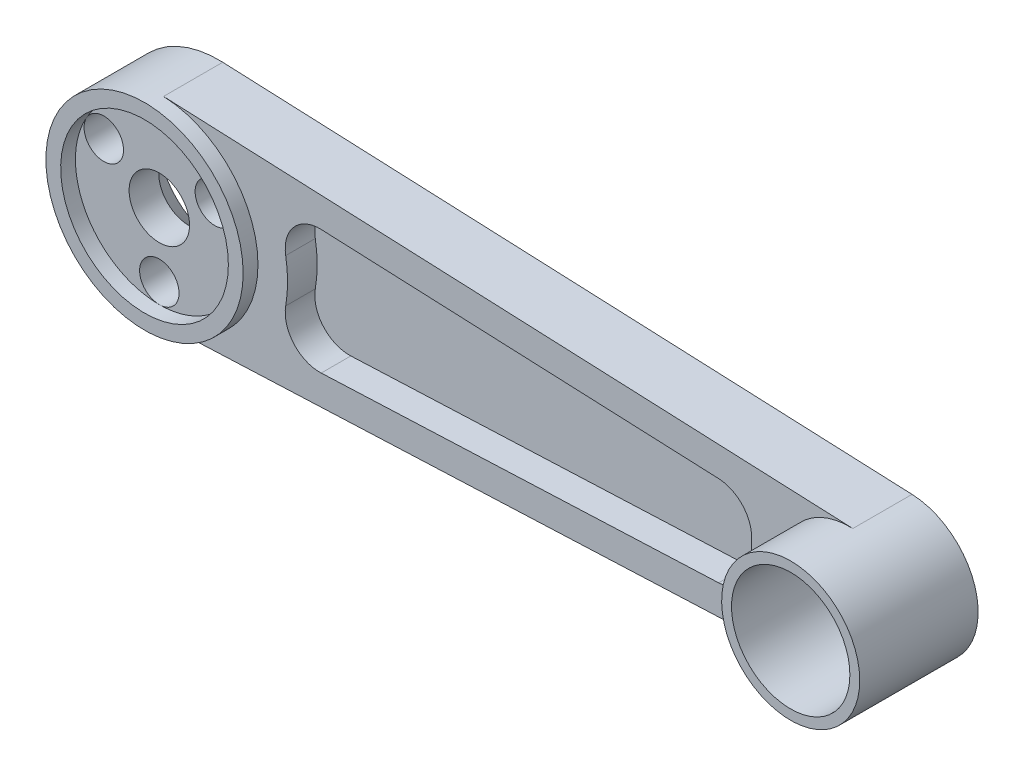
ISO-10303-21;
HEADER;
FILE_DESCRIPTION(('STEP AP214'),'2;1');
FILE_NAME('part.step','',(''),(''),'','','');
FILE_SCHEMA(('AUTOMOTIVE_DESIGN { 1 0 10303 214 1 1 1 1 }'));
ENDSEC;
DATA;
#1=APPLICATION_CONTEXT('core data for automotive mechanical design processes');
#2=APPLICATION_PROTOCOL_DEFINITION('international standard','automotive_design',2000,#1);
#3=PRODUCT_CONTEXT('',#1,'mechanical');
#4=PRODUCT('Part','Part','',(#3));
#5=PRODUCT_RELATED_PRODUCT_CATEGORY('part','',(#4));
#6=PRODUCT_DEFINITION_FORMATION('','',#4);
#7=PRODUCT_DEFINITION_CONTEXT('part definition',#1,'design');
#8=PRODUCT_DEFINITION('design','',#6,#7);
#9=PRODUCT_DEFINITION_SHAPE('','',#8);
#10=(LENGTH_UNIT() NAMED_UNIT(*) SI_UNIT(.MILLI.,.METRE.));
#11=(NAMED_UNIT(*) PLANE_ANGLE_UNIT() SI_UNIT($,.RADIAN.));
#12=(NAMED_UNIT(*) SI_UNIT($,.STERADIAN.) SOLID_ANGLE_UNIT());
#13=UNCERTAINTY_MEASURE_WITH_UNIT(LENGTH_MEASURE(1.E-05),#10,'distance_accuracy_value','');
#14=(GEOMETRIC_REPRESENTATION_CONTEXT(3) GLOBAL_UNCERTAINTY_ASSIGNED_CONTEXT((#13)) GLOBAL_UNIT_ASSIGNED_CONTEXT((#10,
#11,#12)) REPRESENTATION_CONTEXT('',''));
#15=CARTESIAN_POINT('',(0.,0.,0.));
#16=DIRECTION('',(0.,0.,1.));
#17=DIRECTION('',(1.,0.,0.));
#18=AXIS2_PLACEMENT_3D('',#15,#16,#17);
#19=CARTESIAN_POINT('',(0.,0.,6.));
#20=DIRECTION('',(0.,0.,1.));
#21=DIRECTION('',(1.,0.,0.));
#22=AXIS2_PLACEMENT_3D('',#19,#20,#21);
#23=PLANE('',#22);
#24=CARTESIAN_POINT('',(56.5430861553258,1.07771507227869,6.));
#25=DIRECTION('',(0.,0.,1.));
#26=DIRECTION('',(1.,0.,0.));
#27=AXIS2_PLACEMENT_3D('',#24,#25,#26);
#28=CIRCLE('',#27,3.5);
#29=CARTESIAN_POINT('',(60.0319156706117,0.798307460947174,6.));
#30=VERTEX_POINT('',#29);
#31=CARTESIAN_POINT('',(56.6930861553258,4.57449930925986,6.));
#32=VERTEX_POINT('',#31);
#33=EDGE_CURVE('E55',#30,#32,#28,.T.);
#34=ORIENTED_EDGE('',*,*,#33,.F.);
#35=CARTESIAN_POINT('',(70.,0.,6.));
#36=DIRECTION('',(0.,0.,-1.));
#37=DIRECTION('',(-1.,0.,0.));
#38=AXIS2_PLACEMENT_3D('',#35,#36,#37);
#39=CIRCLE('',#38,9.99999999999999);
#40=CARTESIAN_POINT('',(60.0319156706117,-0.798307460947177,6.));
#41=VERTEX_POINT('',#40);
#42=EDGE_CURVE('E159',#41,#30,#39,.T.);
#43=ORIENTED_EDGE('',*,*,#42,.F.);
#44=CARTESIAN_POINT('',(56.5430861553258,-1.07771507227868,6.));
#45=DIRECTION('',(0.,0.,1.));
#46=DIRECTION('',(1.,0.,0.));
#47=AXIS2_PLACEMENT_3D('',#44,#45,#46);
#48=CIRCLE('',#47,3.5);
#49=CARTESIAN_POINT('',(56.6930861553258,-4.57449930925986,6.));
#50=VERTEX_POINT('',#49);
#51=EDGE_CURVE('E162',#50,#41,#48,.T.);
#52=ORIENTED_EDGE('',*,*,#51,.F.);
#53=DIRECTION('',(0.999081210566049,0.0428571428571428,0.));
#54=VECTOR('',#53,1.);
#55=CARTESIAN_POINT('',(16.4097004621313,-6.30251780982247,6.));
#56=LINE('',#55,#54);
#57=CARTESIAN_POINT('',(16.4097004621313,-6.30251780982247,6.));
#58=VERTEX_POINT('',#57);
#59=EDGE_CURVE('E190',#58,#50,#56,.T.);
#60=ORIENTED_EDGE('',*,*,#59,.F.);
#61=CARTESIAN_POINT('',(16.2597004621313,-2.8057335728413,6.));
#62=DIRECTION('',(0.,0.,1.));
#63=DIRECTION('',(1.,0.,0.));
#64=AXIS2_PLACEMENT_3D('',#61,#62,#63);
#65=CIRCLE('',#64,3.5);
#66=CARTESIAN_POINT('',(12.8106730913761,-2.21057796648102,6.));
#67=VERTEX_POINT('',#66);
#68=EDGE_CURVE('E187',#67,#58,#65,.T.);
#69=ORIENTED_EDGE('',*,*,#68,.F.);
#70=CARTESIAN_POINT('',(0.,0.,6.));
#71=DIRECTION('',(0.,0.,-1.));
#72=DIRECTION('',(1.,0.,0.));
#73=AXIS2_PLACEMENT_3D('',#70,#71,#72);
#74=CIRCLE('',#73,13.);
#75=CARTESIAN_POINT('',(12.8106730913761,2.21057796648102,6.));
#76=VERTEX_POINT('',#75);
#77=EDGE_CURVE('E184',#76,#67,#74,.T.);
#78=ORIENTED_EDGE('',*,*,#77,.F.);
#79=CARTESIAN_POINT('',(16.2597004621313,2.8057335728413,6.));
#80=DIRECTION('',(0.,0.,1.));
#81=DIRECTION('',(1.,0.,0.));
#82=AXIS2_PLACEMENT_3D('',#79,#80,#81);
#83=CIRCLE('',#82,3.5);
#84=CARTESIAN_POINT('',(16.4097004621313,6.30251780982247,6.));
#85=VERTEX_POINT('',#84);
#86=EDGE_CURVE('E181',#85,#76,#83,.T.);
#87=ORIENTED_EDGE('',*,*,#86,.F.);
#88=DIRECTION('',(-0.999081210566049,0.0428571428571427,0.));
#89=VECTOR('',#88,1.);
#90=CARTESIAN_POINT('',(16.4097004621313,6.30251780982247,6.));
#91=LINE('',#90,#89);
#92=EDGE_CURVE('E179',#32,#85,#91,.T.);
#93=ORIENTED_EDGE('',*,*,#92,.F.);
#94=EDGE_LOOP('',(#34,#43,#52,#60,#69,#78,#87,#93));
#95=FACE_BOUND('',#94,.T.);
#96=DIRECTION('',(0.999081210566049,0.0428571428571429,0.));
#97=VECTOR('',#96,1.);
#98=CARTESIAN_POINT('',(0.428571428571429,-9.99081210566049,6.));
#99=LINE('',#98,#97);
#100=CARTESIAN_POINT('',(0.428571428571429,-9.99081210566049,6.));
#101=VERTEX_POINT('',#100);
#102=CARTESIAN_POINT('',(70.3,-6.99356847396235,6.));
#103=VERTEX_POINT('',#102);
#104=EDGE_CURVE('E250',#101,#103,#99,.T.);
#105=ORIENTED_EDGE('',*,*,#104,.T.);
#106=CARTESIAN_POINT('',(70.,0.,6.));
#107=DIRECTION('',(0.,0.,1.));
#108=DIRECTION('',(1.,0.,0.));
#109=AXIS2_PLACEMENT_3D('',#106,#107,#108);
#110=CIRCLE('',#109,7.);
#111=CARTESIAN_POINT('',(70.3,6.99356847396235,6.));
#112=VERTEX_POINT('',#111);
#113=EDGE_CURVE('E211',#112,#103,#110,.T.);
#114=ORIENTED_EDGE('',*,*,#113,.F.);
#115=DIRECTION('',(-0.999081210566049,0.0428571428571429,0.));
#116=VECTOR('',#115,1.);
#117=CARTESIAN_POINT('',(0.428571428571429,9.99081210566049,6.));
#118=LINE('',#117,#116);
#119=CARTESIAN_POINT('',(0.428571428571429,9.99081210566049,6.));
#120=VERTEX_POINT('',#119);
#121=EDGE_CURVE('E263',#112,#120,#118,.T.);
#122=ORIENTED_EDGE('',*,*,#121,.T.);
#123=CARTESIAN_POINT('',(0.,0.,6.));
#124=DIRECTION('',(0.,0.,1.));
#125=DIRECTION('',(1.,0.,0.));
#126=AXIS2_PLACEMENT_3D('',#123,#124,#125);
#127=CIRCLE('',#126,10.);
#128=EDGE_CURVE('E275',#101,#120,#127,.T.);
#129=ORIENTED_EDGE('',*,*,#128,.F.);
#130=EDGE_LOOP('',(#105,#114,#122,#129));
#131=FACE_BOUND('',#130,.T.);
#132=ADVANCED_FACE('F40',(#95,#131),#23,.T.);
#133=CARTESIAN_POINT('',(0.,0.,6.));
#134=DIRECTION('',(0.,0.,1.));
#135=DIRECTION('',(1.,0.,0.));
#136=AXIS2_PLACEMENT_3D('',#133,#134,#135);
#137=CIRCLE('',#136,3.0625);
#138=CARTESIAN_POINT('',(3.0625,0.,6.));
#139=VERTEX_POINT('',#138);
#140=EDGE_CURVE('E246',#139,#139,#137,.T.);
#141=ORIENTED_EDGE('',*,*,#140,.F.);
#142=EDGE_LOOP('',(#141));
#143=FACE_BOUND('',#142,.T.);
#144=CARTESIAN_POINT('',(5.62916512459888,3.24999999999995,6.));
#145=DIRECTION('',(0.,0.,1.));
#146=DIRECTION('',(1.,0.,0.));
#147=AXIS2_PLACEMENT_3D('',#144,#145,#146);
#148=CIRCLE('',#147,2.);
#149=CARTESIAN_POINT('',(7.36121593216777,4.24999999999993,6.));
#150=VERTEX_POINT('',#149);
#151=EDGE_CURVE('E227',#150,#150,#148,.T.);
#152=ORIENTED_EDGE('',*,*,#151,.F.);
#153=CARTESIAN_POINT('',(0.,0.,6.));
#154=DIRECTION('',(0.,0.,1.));
#155=DIRECTION('',(1.,0.,0.));
#156=AXIS2_PLACEMENT_3D('',#153,#154,#155);
#157=CIRCLE('',#156,8.5);
#158=CARTESIAN_POINT('',(-7.36121593216771,4.25000000000003,6.));
#159=VERTEX_POINT('',#158);
#160=EDGE_CURVE('E63',#150,#159,#157,.T.);
#161=ORIENTED_EDGE('',*,*,#160,.T.);
#162=CARTESIAN_POINT('',(-5.62916512459884,3.25000000000003,6.));
#163=DIRECTION('',(0.,0.,1.));
#164=DIRECTION('',(1.,0.,0.));
#165=AXIS2_PLACEMENT_3D('',#162,#163,#164);
#166=CIRCLE('',#165,2.);
#167=EDGE_CURVE('E231',#159,#159,#166,.T.);
#168=ORIENTED_EDGE('',*,*,#167,.F.);
#169=CARTESIAN_POINT('',(0.,-8.5,6.));
#170=VERTEX_POINT('',#169);
#171=EDGE_CURVE('E223',#159,#170,#157,.T.);
#172=ORIENTED_EDGE('',*,*,#171,.T.);
#173=CARTESIAN_POINT('',(0.,-6.5,6.));
#174=DIRECTION('',(0.,0.,1.));
#175=DIRECTION('',(1.,0.,0.));
#176=AXIS2_PLACEMENT_3D('',#173,#174,#175);
#177=CIRCLE('',#176,2.);
#178=EDGE_CURVE('E237',#170,#170,#177,.T.);
#179=ORIENTED_EDGE('',*,*,#178,.F.);
#180=EDGE_CURVE('E224',#170,#150,#157,.T.);
#181=ORIENTED_EDGE('',*,*,#180,.T.);
#182=EDGE_LOOP('',(#152,#161,#168,#172,#179,#181));
#183=FACE_BOUND('',#182,.T.);
#184=ADVANCED_FACE('F309',(#143,#183),#23,.T.);
#185=CARTESIAN_POINT('',(70.,0.,6.));
#186=DIRECTION('',(0.,0.,-1.));
#187=DIRECTION('',(-1.,0.,0.));
#188=AXIS2_PLACEMENT_3D('',#185,#186,#187);
#189=CYLINDRICAL_SURFACE('',#188,7.);
#190=CARTESIAN_POINT('',(70.,0.,0.));
#191=DIRECTION('',(0.,0.,1.));
#192=DIRECTION('',(1.,0.,0.));
#193=AXIS2_PLACEMENT_3D('',#190,#191,#192);
#194=CIRCLE('',#193,7.);
#195=CARTESIAN_POINT('',(70.3,-6.99356847396235,0.));
#196=VERTEX_POINT('',#195);
#197=CARTESIAN_POINT('',(70.3,6.99356847396234,0.));
#198=VERTEX_POINT('',#197);
#199=EDGE_CURVE('E253',#196,#198,#194,.T.);
#200=ORIENTED_EDGE('',*,*,#199,.T.);
#201=DIRECTION('',(0.,0.,-1.));
#202=VECTOR('',#201,1.);
#203=CARTESIAN_POINT('',(70.3,6.99356847396234,6.));
#204=LINE('',#203,#202);
#205=EDGE_CURVE('E267',#112,#198,#204,.T.);
#206=ORIENTED_EDGE('',*,*,#205,.F.);
#207=ORIENTED_EDGE('',*,*,#113,.T.);
#208=DIRECTION('',(0.,0.,-1.));
#209=VECTOR('',#208,1.);
#210=CARTESIAN_POINT('',(70.3,-6.99356847396235,6.));
#211=LINE('',#210,#209);
#212=EDGE_CURVE('E249',#103,#196,#211,.T.);
#213=ORIENTED_EDGE('',*,*,#212,.T.);
#214=EDGE_LOOP('',(#200,#206,#207,#213));
#215=FACE_BOUND('',#214,.T.);
#216=CARTESIAN_POINT('',(70.,0.,12.));
#217=DIRECTION('',(0.,0.,1.));
#218=DIRECTION('',(1.,0.,0.));
#219=AXIS2_PLACEMENT_3D('',#216,#217,#218);
#220=CIRCLE('',#219,7.);
#221=CARTESIAN_POINT('',(77.,0.,12.));
#222=VERTEX_POINT('',#221);
#223=EDGE_CURVE('E212',#222,#222,#220,.T.);
#224=ORIENTED_EDGE('',*,*,#223,.F.);
#225=EDGE_LOOP('',(#224));
#226=FACE_BOUND('',#225,.T.);
#227=ADVANCED_FACE('F315',(#215,#226),#189,.T.);
#228=CARTESIAN_POINT('',(0.428571428571429,9.99081210566049,6.));
#229=DIRECTION('',(-0.0428571428571429,-0.999081210566049,0.));
#230=DIRECTION('',(0.999081210566049,-0.0428571428571429,0.));
#231=AXIS2_PLACEMENT_3D('',#228,#229,#230);
#232=PLANE('',#231);
#233=DIRECTION('',(-0.999081210566049,0.0428571428571429,0.));
#234=VECTOR('',#233,1.);
#235=CARTESIAN_POINT('',(0.428571428571429,9.99081210566049,0.));
#236=LINE('',#235,#234);
#237=CARTESIAN_POINT('',(0.428571428571429,9.99081210566049,0.));
#238=VERTEX_POINT('',#237);
#239=EDGE_CURVE('E256',#198,#238,#236,.T.);
#240=ORIENTED_EDGE('',*,*,#239,.T.);
#241=DIRECTION('',(0.,0.,-1.));
#242=VECTOR('',#241,1.);
#243=CARTESIAN_POINT('',(0.428571428571429,9.99081210566049,6.));
#244=LINE('',#243,#242);
#245=EDGE_CURVE('E270',#120,#238,#244,.T.);
#246=ORIENTED_EDGE('',*,*,#245,.F.);
#247=ORIENTED_EDGE('',*,*,#121,.F.);
#248=ORIENTED_EDGE('',*,*,#205,.T.);
#249=EDGE_LOOP('',(#240,#246,#247,#248));
#250=FACE_BOUND('',#249,.T.);
#251=ADVANCED_FACE('F336',(#250),#232,.F.);
#252=CARTESIAN_POINT('',(0.,0.,6.));
#253=DIRECTION('',(0.,0.,-1.));
#254=DIRECTION('',(-1.,0.,0.));
#255=AXIS2_PLACEMENT_3D('',#252,#253,#254);
#256=CYLINDRICAL_SURFACE('',#255,10.);
#257=CARTESIAN_POINT('',(0.,0.,0.));
#258=DIRECTION('',(0.,0.,1.));
#259=DIRECTION('',(1.,0.,0.));
#260=AXIS2_PLACEMENT_3D('',#257,#258,#259);
#261=CIRCLE('',#260,10.);
#262=CARTESIAN_POINT('',(0.428571428571429,-9.99081210566049,0.));
#263=VERTEX_POINT('',#262);
#264=EDGE_CURVE('E258',#238,#263,#261,.T.);
#265=ORIENTED_EDGE('',*,*,#264,.T.);
#266=DIRECTION('',(0.,0.,-1.));
#267=VECTOR('',#266,1.);
#268=CARTESIAN_POINT('',(0.428571428571429,-9.99081210566049,6.));
#269=LINE('',#268,#267);
#270=EDGE_CURVE('E266',#101,#263,#269,.T.);
#271=ORIENTED_EDGE('',*,*,#270,.F.);
#272=ORIENTED_EDGE('',*,*,#128,.T.);
#273=ORIENTED_EDGE('',*,*,#245,.T.);
#274=EDGE_LOOP('',(#265,#271,#272,#273));
#275=FACE_BOUND('',#274,.T.);
#276=CARTESIAN_POINT('',(0.,0.,7.5));
#277=DIRECTION('',(0.,0.,1.));
#278=DIRECTION('',(1.,0.,0.));
#279=AXIS2_PLACEMENT_3D('',#276,#277,#278);
#280=CIRCLE('',#279,10.);
#281=CARTESIAN_POINT('',(10.,0.,7.5));
#282=VERTEX_POINT('',#281);
#283=EDGE_CURVE('E221',#282,#282,#280,.T.);
#284=ORIENTED_EDGE('',*,*,#283,.F.);
#285=EDGE_LOOP('',(#284));
#286=FACE_BOUND('',#285,.T.);
#287=ADVANCED_FACE('F332',(#275,#286),#256,.T.);
#288=CARTESIAN_POINT('',(0.428571428571429,-9.99081210566049,6.));
#289=DIRECTION('',(-0.0428571428571429,0.999081210566049,0.));
#290=DIRECTION('',(-0.999081210566049,-0.0428571428571429,0.));
#291=AXIS2_PLACEMENT_3D('',#288,#289,#290);
#292=PLANE('',#291);
#293=DIRECTION('',(0.999081210566049,0.0428571428571429,0.));
#294=VECTOR('',#293,1.);
#295=CARTESIAN_POINT('',(0.428571428571429,-9.99081210566049,0.));
#296=LINE('',#295,#294);
#297=EDGE_CURVE('E260',#263,#196,#296,.T.);
#298=ORIENTED_EDGE('',*,*,#297,.T.);
#299=ORIENTED_EDGE('',*,*,#212,.F.);
#300=ORIENTED_EDGE('',*,*,#104,.F.);
#301=ORIENTED_EDGE('',*,*,#270,.T.);
#302=EDGE_LOOP('',(#298,#299,#300,#301));
#303=FACE_BOUND('',#302,.T.);
#304=ADVANCED_FACE('F329',(#303),#292,.F.);
#305=CARTESIAN_POINT('',(70.,0.,6.));
#306=DIRECTION('',(0.,0.,-1.));
#307=DIRECTION('',(-1.,0.,0.));
#308=AXIS2_PLACEMENT_3D('',#305,#306,#307);
#309=CYLINDRICAL_SURFACE('',#308,6.);
#310=CARTESIAN_POINT('',(70.,0.,0.));
#311=DIRECTION('',(0.,0.,1.));
#312=DIRECTION('',(1.,0.,0.));
#313=AXIS2_PLACEMENT_3D('',#310,#311,#312);
#314=CIRCLE('',#313,6.);
#315=CARTESIAN_POINT('',(76.,0.,0.));
#316=VERTEX_POINT('',#315);
#317=EDGE_CURVE('E243',#316,#316,#314,.T.);
#318=ORIENTED_EDGE('',*,*,#317,.F.);
#319=EDGE_LOOP('',(#318));
#320=FACE_BOUND('',#319,.T.);
#321=CARTESIAN_POINT('',(70.,0.,12.));
#322=DIRECTION('',(0.,0.,1.));
#323=DIRECTION('',(1.,0.,0.));
#324=AXIS2_PLACEMENT_3D('',#321,#322,#323);
#325=CIRCLE('',#324,6.);
#326=CARTESIAN_POINT('',(76.,0.,12.));
#327=VERTEX_POINT('',#326);
#328=EDGE_CURVE('E197',#327,#327,#325,.T.);
#329=ORIENTED_EDGE('',*,*,#328,.T.);
#330=EDGE_LOOP('',(#329));
#331=FACE_BOUND('',#330,.T.);
#332=ADVANCED_FACE('F327',(#320,#331),#309,.F.);
#333=CARTESIAN_POINT('',(0.,0.,6.));
#334=DIRECTION('',(0.,0.,-1.));
#335=DIRECTION('',(-1.,0.,0.));
#336=AXIS2_PLACEMENT_3D('',#333,#334,#335);
#337=CYLINDRICAL_SURFACE('',#336,3.0625);
#338=CARTESIAN_POINT('',(0.,0.,3.));
#339=DIRECTION('',(0.,0.,1.));
#340=DIRECTION('',(1.,0.,0.));
#341=AXIS2_PLACEMENT_3D('',#338,#339,#340);
#342=CIRCLE('',#341,3.0625);
#343=CARTESIAN_POINT('',(3.0625,0.,3.));
#344=VERTEX_POINT('',#343);
#345=EDGE_CURVE('E11',#344,#344,#342,.F.);
#346=ORIENTED_EDGE('',*,*,#345,.T.);
#347=EDGE_LOOP('',(#346));
#348=FACE_BOUND('',#347,.T.);
#349=ORIENTED_EDGE('',*,*,#140,.T.);
#350=EDGE_LOOP('',(#349));
#351=FACE_BOUND('',#350,.T.);
#352=ADVANCED_FACE('F324',(#348,#351),#337,.F.);
#353=CARTESIAN_POINT('',(0.,0.,0.));
#354=DIRECTION('',(0.,0.,1.));
#355=DIRECTION('',(1.,0.,0.));
#356=AXIS2_PLACEMENT_3D('',#353,#354,#355);
#357=PLANE('',#356);
#358=CARTESIAN_POINT('',(0.,0.,0.));
#359=DIRECTION('',(0.,0.,1.));
#360=DIRECTION('',(1.,0.,0.));
#361=AXIS2_PLACEMENT_3D('',#358,#359,#360);
#362=CIRCLE('',#361,6.06249999999998);
#363=CARTESIAN_POINT('',(6.06249999999998,0.,0.));
#364=VERTEX_POINT('',#363);
#365=EDGE_CURVE('E48',#364,#364,#362,.T.);
#366=ORIENTED_EDGE('',*,*,#365,.T.);
#367=EDGE_LOOP('',(#366));
#368=FACE_BOUND('',#367,.T.);
#369=ORIENTED_EDGE('',*,*,#317,.T.);
#370=EDGE_LOOP('',(#369));
#371=FACE_BOUND('',#370,.T.);
#372=ORIENTED_EDGE('',*,*,#199,.F.);
#373=ORIENTED_EDGE('',*,*,#297,.F.);
#374=ORIENTED_EDGE('',*,*,#264,.F.);
#375=ORIENTED_EDGE('',*,*,#239,.F.);
#376=EDGE_LOOP('',(#372,#373,#374,#375));
#377=FACE_BOUND('',#376,.T.);
#378=ADVANCED_FACE('F291',(#368,#371,#377),#357,.F.);
#379=CARTESIAN_POINT('',(0.,-6.5,1.5));
#380=DIRECTION('',(0.,0.,1.));
#381=DIRECTION('',(1.,0.,0.));
#382=AXIS2_PLACEMENT_3D('',#379,#380,#381);
#383=CYLINDRICAL_SURFACE('',#382,2.);
#384=CARTESIAN_POINT('',(0.,-6.5,1.5));
#385=DIRECTION('',(0.,0.,1.));
#386=DIRECTION('',(1.,0.,0.));
#387=AXIS2_PLACEMENT_3D('',#384,#385,#386);
#388=CIRCLE('',#387,2.);
#389=CARTESIAN_POINT('',(2.,-6.5,1.5));
#390=VERTEX_POINT('',#389);
#391=EDGE_CURVE('E240',#390,#390,#388,.T.);
#392=ORIENTED_EDGE('',*,*,#391,.F.);
#393=EDGE_LOOP('',(#392));
#394=FACE_BOUND('',#393,.T.);
#395=ORIENTED_EDGE('',*,*,#178,.T.);
#396=EDGE_LOOP('',(#395));
#397=FACE_BOUND('',#396,.T.);
#398=ADVANCED_FACE('F320',(#394,#397),#383,.F.);
#399=CARTESIAN_POINT('',(0.,-6.5,1.5));
#400=DIRECTION('',(0.,0.,1.));
#401=DIRECTION('',(1.,0.,0.));
#402=AXIS2_PLACEMENT_3D('',#399,#400,#401);
#403=PLANE('',#402);
#404=ORIENTED_EDGE('',*,*,#391,.T.);
#405=EDGE_LOOP('',(#404));
#406=FACE_BOUND('',#405,.T.);
#407=ADVANCED_FACE('F388',(#406),#403,.T.);
#408=CARTESIAN_POINT('',(-5.62916512459884,3.25000000000003,1.5));
#409=DIRECTION('',(0.,0.,1.));
#410=DIRECTION('',(1.,0.,0.));
#411=AXIS2_PLACEMENT_3D('',#408,#409,#410);
#412=CYLINDRICAL_SURFACE('',#411,2.);
#413=CARTESIAN_POINT('',(-5.62916512459884,3.25000000000003,1.5));
#414=DIRECTION('',(0.,0.,1.));
#415=DIRECTION('',(1.,0.,0.));
#416=AXIS2_PLACEMENT_3D('',#413,#414,#415);
#417=CIRCLE('',#416,2.);
#418=CARTESIAN_POINT('',(-3.62916512459884,3.25000000000003,1.5));
#419=VERTEX_POINT('',#418);
#420=EDGE_CURVE('E234',#419,#419,#417,.T.);
#421=ORIENTED_EDGE('',*,*,#420,.F.);
#422=EDGE_LOOP('',(#421));
#423=FACE_BOUND('',#422,.T.);
#424=ORIENTED_EDGE('',*,*,#167,.T.);
#425=EDGE_LOOP('',(#424));
#426=FACE_BOUND('',#425,.T.);
#427=ADVANCED_FACE('F385',(#423,#426),#412,.F.);
#428=CARTESIAN_POINT('',(-5.62916512459884,3.25000000000003,1.5));
#429=DIRECTION('',(0.,0.,1.));
#430=DIRECTION('',(1.,0.,0.));
#431=AXIS2_PLACEMENT_3D('',#428,#429,#430);
#432=PLANE('',#431);
#433=ORIENTED_EDGE('',*,*,#420,.T.);
#434=EDGE_LOOP('',(#433));
#435=FACE_BOUND('',#434,.T.);
#436=ADVANCED_FACE('F381',(#435),#432,.T.);
#437=CARTESIAN_POINT('',(5.62916512459888,3.24999999999995,1.5));
#438=DIRECTION('',(0.,0.,1.));
#439=DIRECTION('',(1.,0.,0.));
#440=AXIS2_PLACEMENT_3D('',#437,#438,#439);
#441=CYLINDRICAL_SURFACE('',#440,2.);
#442=CARTESIAN_POINT('',(5.62916512459888,3.24999999999995,1.5));
#443=DIRECTION('',(0.,0.,1.));
#444=DIRECTION('',(1.,0.,0.));
#445=AXIS2_PLACEMENT_3D('',#442,#443,#444);
#446=CIRCLE('',#445,2.);
#447=CARTESIAN_POINT('',(7.62916512459888,3.24999999999995,1.5));
#448=VERTEX_POINT('',#447);
#449=EDGE_CURVE('E228',#448,#448,#446,.T.);
#450=ORIENTED_EDGE('',*,*,#449,.F.);
#451=EDGE_LOOP('',(#450));
#452=FACE_BOUND('',#451,.T.);
#453=ORIENTED_EDGE('',*,*,#151,.T.);
#454=EDGE_LOOP('',(#453));
#455=FACE_BOUND('',#454,.T.);
#456=ADVANCED_FACE('F375',(#452,#455),#441,.F.);
#457=CARTESIAN_POINT('',(5.62916512459888,3.24999999999995,1.5));
#458=DIRECTION('',(0.,0.,1.));
#459=DIRECTION('',(1.,0.,0.));
#460=AXIS2_PLACEMENT_3D('',#457,#458,#459);
#461=PLANE('',#460);
#462=ORIENTED_EDGE('',*,*,#449,.T.);
#463=EDGE_LOOP('',(#462));
#464=FACE_BOUND('',#463,.T.);
#465=ADVANCED_FACE('F369',(#464),#461,.T.);
#466=CARTESIAN_POINT('',(0.,0.,7.5));
#467=DIRECTION('',(0.,0.,1.));
#468=DIRECTION('',(1.,0.,0.));
#469=AXIS2_PLACEMENT_3D('',#466,#467,#468);
#470=PLANE('',#469);
#471=ORIENTED_EDGE('',*,*,#283,.T.);
#472=EDGE_LOOP('',(#471));
#473=FACE_BOUND('',#472,.T.);
#474=CARTESIAN_POINT('',(0.,0.,7.5));
#475=DIRECTION('',(0.,0.,1.));
#476=DIRECTION('',(1.,0.,0.));
#477=AXIS2_PLACEMENT_3D('',#474,#475,#476);
#478=CIRCLE('',#477,8.5);
#479=CARTESIAN_POINT('',(8.5,0.,7.5));
#480=VERTEX_POINT('',#479);
#481=EDGE_CURVE('E218',#480,#480,#478,.T.);
#482=ORIENTED_EDGE('',*,*,#481,.F.);
#483=EDGE_LOOP('',(#482));
#484=FACE_BOUND('',#483,.T.);
#485=ADVANCED_FACE('F304',(#473,#484),#470,.T.);
#486=CARTESIAN_POINT('',(0.,0.,7.5));
#487=DIRECTION('',(0.,0.,-1.));
#488=DIRECTION('',(-1.,0.,0.));
#489=AXIS2_PLACEMENT_3D('',#486,#487,#488);
#490=CYLINDRICAL_SURFACE('',#489,8.5);
#491=ORIENTED_EDGE('',*,*,#481,.T.);
#492=EDGE_LOOP('',(#491));
#493=FACE_BOUND('',#492,.T.);
#494=ORIENTED_EDGE('',*,*,#160,.F.);
#495=ORIENTED_EDGE('',*,*,#180,.F.);
#496=ORIENTED_EDGE('',*,*,#171,.F.);
#497=EDGE_LOOP('',(#494,#495,#496));
#498=FACE_BOUND('',#497,.T.);
#499=ADVANCED_FACE('F296',(#493,#498),#490,.F.);
#500=CARTESIAN_POINT('',(0.,0.,0.));
#501=DIRECTION('',(0.,0.,-1.));
#502=DIRECTION('',(-1.,0.,0.));
#503=AXIS2_PLACEMENT_3D('',#500,#501,#502);
#504=CONICAL_SURFACE('',#503,6.06249999999998,0.785398163397445);
#505=ORIENTED_EDGE('',*,*,#345,.F.);
#506=EDGE_LOOP('',(#505));
#507=FACE_BOUND('',#506,.T.);
#508=ORIENTED_EDGE('',*,*,#365,.F.);
#509=EDGE_LOOP('',(#508));
#510=FACE_BOUND('',#509,.T.);
#511=ADVANCED_FACE('F42',(#507,#510),#504,.F.);
#512=CARTESIAN_POINT('',(70.,0.,12.));
#513=DIRECTION('',(0.,0.,1.));
#514=DIRECTION('',(1.,0.,0.));
#515=AXIS2_PLACEMENT_3D('',#512,#513,#514);
#516=PLANE('',#515);
#517=ORIENTED_EDGE('',*,*,#223,.T.);
#518=EDGE_LOOP('',(#517));
#519=FACE_BOUND('',#518,.T.);
#520=ORIENTED_EDGE('',*,*,#328,.F.);
#521=EDGE_LOOP('',(#520));
#522=FACE_BOUND('',#521,.T.);
#523=ADVANCED_FACE('F295',(#519,#522),#516,.T.);
#524=CARTESIAN_POINT('',(56.5430861553258,1.07771507227869,3.));
#525=DIRECTION('',(0.,0.,1.));
#526=DIRECTION('',(1.,0.,0.));
#527=AXIS2_PLACEMENT_3D('',#524,#525,#526);
#528=CYLINDRICAL_SURFACE('',#527,3.5);
#529=ORIENTED_EDGE('',*,*,#33,.T.);
#530=DIRECTION('',(0.,0.,1.));
#531=VECTOR('',#530,1.);
#532=CARTESIAN_POINT('',(56.6930861553258,4.57449930925986,3.));
#533=LINE('',#532,#531);
#534=CARTESIAN_POINT('',(56.6930861553258,4.57449930925986,3.));
#535=VERTEX_POINT('',#534);
#536=EDGE_CURVE('E136',#535,#32,#533,.T.);
#537=ORIENTED_EDGE('',*,*,#536,.F.);
#538=CARTESIAN_POINT('',(56.5430861553258,1.07771507227869,3.));
#539=DIRECTION('',(0.,0.,1.));
#540=DIRECTION('',(1.,0.,0.));
#541=AXIS2_PLACEMENT_3D('',#538,#539,#540);
#542=CIRCLE('',#541,3.5);
#543=CARTESIAN_POINT('',(60.0319156706117,0.798307460947174,3.));
#544=VERTEX_POINT('',#543);
#545=EDGE_CURVE('E140',#544,#535,#542,.T.);
#546=ORIENTED_EDGE('',*,*,#545,.F.);
#547=DIRECTION('',(0.,0.,1.));
#548=VECTOR('',#547,1.);
#549=CARTESIAN_POINT('',(60.0319156706117,0.798307460947174,3.));
#550=LINE('',#549,#548);
#551=EDGE_CURVE('E195',#544,#30,#550,.T.);
#552=ORIENTED_EDGE('',*,*,#551,.T.);
#553=EDGE_LOOP('',(#529,#537,#546,#552));
#554=FACE_BOUND('',#553,.T.);
#555=ADVANCED_FACE('F138',(#554),#528,.F.);
#556=CARTESIAN_POINT('',(70.,0.,3.));
#557=DIRECTION('',(0.,0.,1.));
#558=DIRECTION('',(1.,0.,0.));
#559=AXIS2_PLACEMENT_3D('',#556,#557,#558);
#560=CYLINDRICAL_SURFACE('',#559,9.99999999999999);
#561=ORIENTED_EDGE('',*,*,#42,.T.);
#562=ORIENTED_EDGE('',*,*,#551,.F.);
#563=CARTESIAN_POINT('',(70.,0.,3.));
#564=DIRECTION('',(0.,0.,-1.));
#565=DIRECTION('',(-1.,0.,0.));
#566=AXIS2_PLACEMENT_3D('',#563,#564,#565);
#567=CIRCLE('',#566,9.99999999999999);
#568=CARTESIAN_POINT('',(60.0319156706117,-0.798307460947177,3.));
#569=VERTEX_POINT('',#568);
#570=EDGE_CURVE('E146',#569,#544,#567,.T.);
#571=ORIENTED_EDGE('',*,*,#570,.F.);
#572=DIRECTION('',(0.,0.,1.));
#573=VECTOR('',#572,1.);
#574=CARTESIAN_POINT('',(60.0319156706117,-0.798307460947177,3.));
#575=LINE('',#574,#573);
#576=EDGE_CURVE('E198',#569,#41,#575,.T.);
#577=ORIENTED_EDGE('',*,*,#576,.T.);
#578=EDGE_LOOP('',(#561,#562,#571,#577));
#579=FACE_BOUND('',#578,.T.);
#580=ADVANCED_FACE('F530',(#579),#560,.T.);
#581=CARTESIAN_POINT('',(56.5430861553258,-1.07771507227868,3.));
#582=DIRECTION('',(0.,0.,1.));
#583=DIRECTION('',(1.,0.,0.));
#584=AXIS2_PLACEMENT_3D('',#581,#582,#583);
#585=CYLINDRICAL_SURFACE('',#584,3.5);
#586=ORIENTED_EDGE('',*,*,#51,.T.);
#587=ORIENTED_EDGE('',*,*,#576,.F.);
#588=CARTESIAN_POINT('',(56.5430861553258,-1.07771507227868,3.));
#589=DIRECTION('',(0.,0.,1.));
#590=DIRECTION('',(1.,0.,0.));
#591=AXIS2_PLACEMENT_3D('',#588,#589,#590);
#592=CIRCLE('',#591,3.5);
#593=CARTESIAN_POINT('',(56.6930861553258,-4.57449930925986,3.));
#594=VERTEX_POINT('',#593);
#595=EDGE_CURVE('E175',#594,#569,#592,.T.);
#596=ORIENTED_EDGE('',*,*,#595,.F.);
#597=DIRECTION('',(0.,0.,1.));
#598=VECTOR('',#597,1.);
#599=CARTESIAN_POINT('',(56.6930861553258,-4.57449930925986,3.));
#600=LINE('',#599,#598);
#601=EDGE_CURVE('E200',#594,#50,#600,.T.);
#602=ORIENTED_EDGE('',*,*,#601,.T.);
#603=EDGE_LOOP('',(#586,#587,#596,#602));
#604=FACE_BOUND('',#603,.T.);
#605=ADVANCED_FACE('F538',(#604),#585,.F.);
#606=CARTESIAN_POINT('',(16.4097004621313,-6.30251780982247,3.));
#607=DIRECTION('',(0.0428571428571428,-0.999081210566049,0.));
#608=DIRECTION('',(0.999081210566049,0.0428571428571428,0.));
#609=AXIS2_PLACEMENT_3D('',#606,#607,#608);
#610=PLANE('',#609);
#611=ORIENTED_EDGE('',*,*,#59,.T.);
#612=ORIENTED_EDGE('',*,*,#601,.F.);
#613=DIRECTION('',(0.999081210566049,0.0428571428571428,0.));
#614=VECTOR('',#613,1.);
#615=CARTESIAN_POINT('',(16.4097004621313,-6.30251780982247,3.));
#616=LINE('',#615,#614);
#617=CARTESIAN_POINT('',(16.4097004621313,-6.30251780982247,3.));
#618=VERTEX_POINT('',#617);
#619=EDGE_CURVE('E172',#618,#594,#616,.T.);
#620=ORIENTED_EDGE('',*,*,#619,.F.);
#621=DIRECTION('',(0.,0.,1.));
#622=VECTOR('',#621,1.);
#623=CARTESIAN_POINT('',(16.4097004621313,-6.30251780982247,3.));
#624=LINE('',#623,#622);
#625=EDGE_CURVE('E202',#618,#58,#624,.T.);
#626=ORIENTED_EDGE('',*,*,#625,.T.);
#627=EDGE_LOOP('',(#611,#612,#620,#626));
#628=FACE_BOUND('',#627,.T.);
#629=ADVANCED_FACE('F547',(#628),#610,.F.);
#630=CARTESIAN_POINT('',(16.2597004621313,-2.8057335728413,3.));
#631=DIRECTION('',(0.,0.,1.));
#632=DIRECTION('',(1.,0.,0.));
#633=AXIS2_PLACEMENT_3D('',#630,#631,#632);
#634=CYLINDRICAL_SURFACE('',#633,3.5);
#635=ORIENTED_EDGE('',*,*,#68,.T.);
#636=ORIENTED_EDGE('',*,*,#625,.F.);
#637=CARTESIAN_POINT('',(16.2597004621313,-2.8057335728413,3.));
#638=DIRECTION('',(0.,0.,1.));
#639=DIRECTION('',(1.,0.,0.));
#640=AXIS2_PLACEMENT_3D('',#637,#638,#639);
#641=CIRCLE('',#640,3.5);
#642=CARTESIAN_POINT('',(12.8106730913761,-2.21057796648102,3.));
#643=VERTEX_POINT('',#642);
#644=EDGE_CURVE('E169',#643,#618,#641,.T.);
#645=ORIENTED_EDGE('',*,*,#644,.F.);
#646=DIRECTION('',(0.,0.,1.));
#647=VECTOR('',#646,1.);
#648=CARTESIAN_POINT('',(12.8106730913761,-2.21057796648102,3.));
#649=LINE('',#648,#647);
#650=EDGE_CURVE('E204',#643,#67,#649,.T.);
#651=ORIENTED_EDGE('',*,*,#650,.T.);
#652=EDGE_LOOP('',(#635,#636,#645,#651));
#653=FACE_BOUND('',#652,.T.);
#654=ADVANCED_FACE('F556',(#653),#634,.F.);
#655=CARTESIAN_POINT('',(0.,0.,3.));
#656=DIRECTION('',(0.,0.,1.));
#657=DIRECTION('',(1.,0.,0.));
#658=AXIS2_PLACEMENT_3D('',#655,#656,#657);
#659=CYLINDRICAL_SURFACE('',#658,13.);
#660=ORIENTED_EDGE('',*,*,#77,.T.);
#661=ORIENTED_EDGE('',*,*,#650,.F.);
#662=CARTESIAN_POINT('',(0.,0.,3.));
#663=DIRECTION('',(0.,0.,-1.));
#664=DIRECTION('',(1.,0.,0.));
#665=AXIS2_PLACEMENT_3D('',#662,#663,#664);
#666=CIRCLE('',#665,13.);
#667=CARTESIAN_POINT('',(12.8106730913761,2.21057796648102,3.));
#668=VERTEX_POINT('',#667);
#669=EDGE_CURVE('E166',#668,#643,#666,.T.);
#670=ORIENTED_EDGE('',*,*,#669,.F.);
#671=DIRECTION('',(0.,0.,1.));
#672=VECTOR('',#671,1.);
#673=CARTESIAN_POINT('',(12.8106730913761,2.21057796648102,3.));
#674=LINE('',#673,#672);
#675=EDGE_CURVE('E206',#668,#76,#674,.T.);
#676=ORIENTED_EDGE('',*,*,#675,.T.);
#677=EDGE_LOOP('',(#660,#661,#670,#676));
#678=FACE_BOUND('',#677,.T.);
#679=ADVANCED_FACE('F565',(#678),#659,.T.);
#680=CARTESIAN_POINT('',(16.2597004621313,2.8057335728413,3.));
#681=DIRECTION('',(0.,0.,1.));
#682=DIRECTION('',(1.,0.,0.));
#683=AXIS2_PLACEMENT_3D('',#680,#681,#682);
#684=CYLINDRICAL_SURFACE('',#683,3.5);
#685=ORIENTED_EDGE('',*,*,#86,.T.);
#686=ORIENTED_EDGE('',*,*,#675,.F.);
#687=CARTESIAN_POINT('',(16.2597004621313,2.8057335728413,3.));
#688=DIRECTION('',(0.,0.,1.));
#689=DIRECTION('',(1.,0.,0.));
#690=AXIS2_PLACEMENT_3D('',#687,#688,#689);
#691=CIRCLE('',#690,3.5);
#692=CARTESIAN_POINT('',(16.4097004621313,6.30251780982247,3.));
#693=VERTEX_POINT('',#692);
#694=EDGE_CURVE('E154',#693,#668,#691,.T.);
#695=ORIENTED_EDGE('',*,*,#694,.F.);
#696=DIRECTION('',(0.,0.,1.));
#697=VECTOR('',#696,1.);
#698=CARTESIAN_POINT('',(16.4097004621313,6.30251780982247,3.));
#699=LINE('',#698,#697);
#700=EDGE_CURVE('E145',#693,#85,#699,.T.);
#701=ORIENTED_EDGE('',*,*,#700,.T.);
#702=EDGE_LOOP('',(#685,#686,#695,#701));
#703=FACE_BOUND('',#702,.T.);
#704=ADVANCED_FACE('F574',(#703),#684,.F.);
#705=CARTESIAN_POINT('',(16.4097004621313,6.30251780982247,3.));
#706=DIRECTION('',(0.0428571428571427,0.999081210566049,0.));
#707=DIRECTION('',(-0.999081210566049,0.0428571428571427,0.));
#708=AXIS2_PLACEMENT_3D('',#705,#706,#707);
#709=PLANE('',#708);
#710=ORIENTED_EDGE('',*,*,#92,.T.);
#711=ORIENTED_EDGE('',*,*,#700,.F.);
#712=DIRECTION('',(-0.999081210566049,0.0428571428571427,0.));
#713=VECTOR('',#712,1.);
#714=CARTESIAN_POINT('',(16.4097004621313,6.30251780982247,3.));
#715=LINE('',#714,#713);
#716=EDGE_CURVE('E149',#535,#693,#715,.T.);
#717=ORIENTED_EDGE('',*,*,#716,.F.);
#718=ORIENTED_EDGE('',*,*,#536,.T.);
#719=EDGE_LOOP('',(#710,#711,#717,#718));
#720=FACE_BOUND('',#719,.T.);
#721=ADVANCED_FACE('F150',(#720),#709,.F.);
#722=CARTESIAN_POINT('',(56.5430861553258,1.07771507227869,3.));
#723=DIRECTION('',(0.,0.,1.));
#724=DIRECTION('',(1.,0.,0.));
#725=AXIS2_PLACEMENT_3D('',#722,#723,#724);
#726=PLANE('',#725);
#727=ORIENTED_EDGE('',*,*,#545,.T.);
#728=ORIENTED_EDGE('',*,*,#716,.T.);
#729=ORIENTED_EDGE('',*,*,#694,.T.);
#730=ORIENTED_EDGE('',*,*,#669,.T.);
#731=ORIENTED_EDGE('',*,*,#644,.T.);
#732=ORIENTED_EDGE('',*,*,#619,.T.);
#733=ORIENTED_EDGE('',*,*,#595,.T.);
#734=ORIENTED_EDGE('',*,*,#570,.T.);
#735=EDGE_LOOP('',(#727,#728,#729,#730,#731,#732,#733,#734));
#736=FACE_BOUND('',#735,.T.);
#737=ADVANCED_FACE('F156',(#736),#726,.T.);
#738=CLOSED_SHELL('',(#132,#184,#227,#251,#287,#304,#332,#352,#378,#398,#407,#427,#436,#456,
#465,#485,#499,#511,#523,#555,#580,#605,#629,#654,#679,#704,#721,#737));
#739=MANIFOLD_SOLID_BREP('B2',#738);
#740=ADVANCED_BREP_SHAPE_REPRESENTATION('',(#18,#739),#14);
#741=SHAPE_DEFINITION_REPRESENTATION(#9,#740);
ENDSEC;
END-ISO-10303-21;
